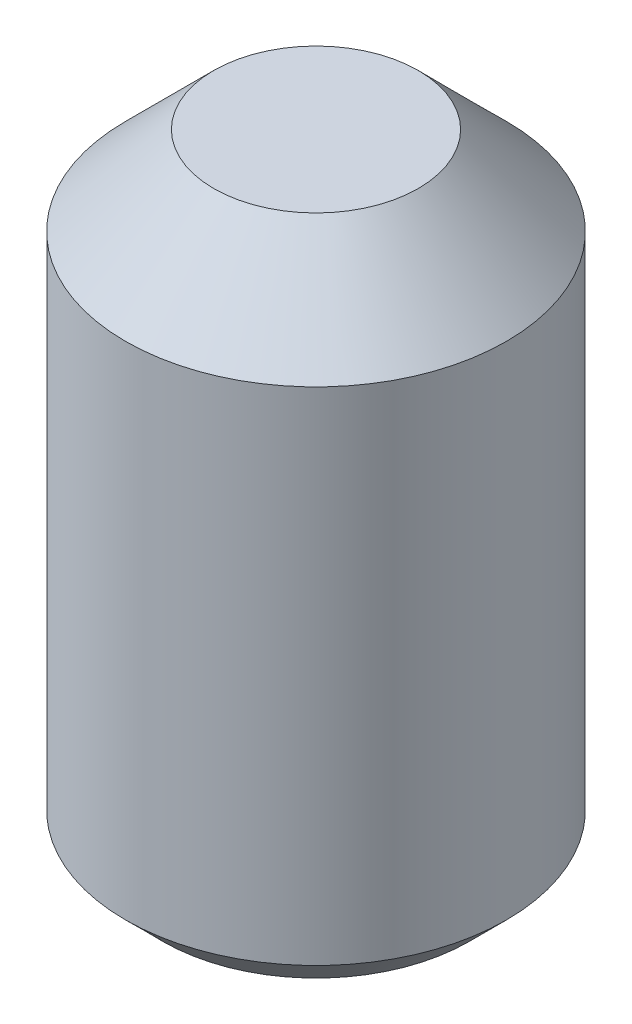
ISO-10303-21;
HEADER;
FILE_DESCRIPTION(('STEP AP214'),'2;1');
FILE_NAME('part.step','',(''),(''),'','','');
FILE_SCHEMA(('AUTOMOTIVE_DESIGN { 1 0 10303 214 1 1 1 1 }'));
ENDSEC;
DATA;
#1=APPLICATION_CONTEXT('core data for automotive mechanical design processes');
#2=APPLICATION_PROTOCOL_DEFINITION('international standard','automotive_design',2000,#1);
#3=PRODUCT_CONTEXT('',#1,'mechanical');
#4=PRODUCT('Part','Part','',(#3));
#5=PRODUCT_RELATED_PRODUCT_CATEGORY('part','',(#4));
#6=PRODUCT_DEFINITION_FORMATION('','',#4);
#7=PRODUCT_DEFINITION_CONTEXT('part definition',#1,'design');
#8=PRODUCT_DEFINITION('design','',#6,#7);
#9=PRODUCT_DEFINITION_SHAPE('','',#8);
#10=(LENGTH_UNIT() NAMED_UNIT(*) SI_UNIT(.MILLI.,.METRE.));
#11=(NAMED_UNIT(*) PLANE_ANGLE_UNIT() SI_UNIT($,.RADIAN.));
#12=(NAMED_UNIT(*) SI_UNIT($,.STERADIAN.) SOLID_ANGLE_UNIT());
#13=UNCERTAINTY_MEASURE_WITH_UNIT(LENGTH_MEASURE(1.E-05),#10,'distance_accuracy_value','');
#14=(GEOMETRIC_REPRESENTATION_CONTEXT(3) GLOBAL_UNCERTAINTY_ASSIGNED_CONTEXT((#13)) GLOBAL_UNIT_ASSIGNED_CONTEXT((#10,
#11,#12)) REPRESENTATION_CONTEXT('',''));
#15=CARTESIAN_POINT('',(0.,0.,0.));
#16=DIRECTION('',(0.,0.,1.));
#17=DIRECTION('',(1.,0.,0.));
#18=AXIS2_PLACEMENT_3D('',#15,#16,#17);
#19=CARTESIAN_POINT('',(0.,0.,0.));
#20=DIRECTION('',(0.,1.,0.));
#21=DIRECTION('',(-1.,0.,0.));
#22=AXIS2_PLACEMENT_3D('',#19,#20,#21);
#23=CYLINDRICAL_SURFACE('',#22,2.413);
#24=CARTESIAN_POINT('',(0.,0.472439999953159,0.));
#25=DIRECTION('',(0.,-1.,0.));
#26=DIRECTION('',(1.,0.,0.));
#27=AXIS2_PLACEMENT_3D('',#24,#25,#26);
#28=CIRCLE('',#27,2.413);
#29=CARTESIAN_POINT('',(2.413,0.472439999953159,0.));
#30=VERTEX_POINT('',#29);
#31=EDGE_CURVE('E41',#30,#30,#28,.F.);
#32=ORIENTED_EDGE('',*,*,#31,.T.);
#33=EDGE_LOOP('',(#32));
#34=FACE_BOUND('',#33,.T.);
#35=CARTESIAN_POINT('',(0.,6.8199,0.));
#36=DIRECTION('',(0.,1.,0.));
#37=DIRECTION('',(-1.,0.,0.));
#38=AXIS2_PLACEMENT_3D('',#35,#36,#37);
#39=CIRCLE('',#38,2.413);
#40=CARTESIAN_POINT('',(-2.413,6.8199,0.));
#41=VERTEX_POINT('',#40);
#42=EDGE_CURVE('E135',#41,#41,#39,.T.);
#43=ORIENTED_EDGE('',*,*,#42,.F.);
#44=EDGE_LOOP('',(#43));
#45=FACE_BOUND('',#44,.T.);
#46=ADVANCED_FACE('F33',(#34,#45),#23,.T.);
#47=CARTESIAN_POINT('',(2.413,0.,0.));
#48=DIRECTION('',(0.,-1.,0.));
#49=DIRECTION('',(1.,0.,0.));
#50=AXIS2_PLACEMENT_3D('',#47,#48,#49);
#51=PLANE('',#50);
#52=CARTESIAN_POINT('',(0.,0.,0.));
#53=DIRECTION('',(0.,-1.,0.));
#54=DIRECTION('',(1.,0.,0.));
#55=AXIS2_PLACEMENT_3D('',#52,#53,#54);
#56=CIRCLE('',#55,1.94056000004684);
#57=CARTESIAN_POINT('',(1.94056000004684,0.,0.));
#58=VERTEX_POINT('',#57);
#59=EDGE_CURVE('E11',#58,#58,#56,.T.);
#60=ORIENTED_EDGE('',*,*,#59,.T.);
#61=EDGE_LOOP('',(#60));
#62=FACE_BOUND('',#61,.T.);
#63=DIRECTION('',(-1.,0.,0.));
#64=VECTOR('',#63,1.);
#65=CARTESIAN_POINT('',(0.687040789999955,0.,1.18998955515204));
#66=LINE('',#65,#64);
#67=CARTESIAN_POINT('',(0.687040789999955,0.,1.18998955515204));
#68=VERTEX_POINT('',#67);
#69=CARTESIAN_POINT('',(-0.687040790000067,0.,1.18998955515204));
#70=VERTEX_POINT('',#69);
#71=EDGE_CURVE('E48',#68,#70,#66,.T.);
#72=ORIENTED_EDGE('',*,*,#71,.F.);
#73=DIRECTION('',(-0.5,0.,0.866025403784439));
#74=VECTOR('',#73,1.);
#75=CARTESIAN_POINT('',(1.37408157999982,0.,0.));
#76=LINE('',#75,#74);
#77=CARTESIAN_POINT('',(1.37408157999982,0.,0.));
#78=VERTEX_POINT('',#77);
#79=EDGE_CURVE('E131',#78,#68,#76,.T.);
#80=ORIENTED_EDGE('',*,*,#79,.F.);
#81=DIRECTION('',(0.5,0.,0.866025403784439));
#82=VECTOR('',#81,1.);
#83=CARTESIAN_POINT('',(0.687040789999932,0.,-1.18998955515205));
#84=LINE('',#83,#82);
#85=CARTESIAN_POINT('',(0.687040789999932,0.,-1.18998955515205));
#86=VERTEX_POINT('',#85);
#87=EDGE_CURVE('E129',#86,#78,#84,.T.);
#88=ORIENTED_EDGE('',*,*,#87,.F.);
#89=DIRECTION('',(1.,0.,0.));
#90=VECTOR('',#89,1.);
#91=CARTESIAN_POINT('',(-0.68704079000009,0.,-1.18998955515205));
#92=LINE('',#91,#90);
#93=CARTESIAN_POINT('',(-0.68704079000009,0.,-1.18998955515205));
#94=VERTEX_POINT('',#93);
#95=EDGE_CURVE('E96',#94,#86,#92,.T.);
#96=ORIENTED_EDGE('',*,*,#95,.F.);
#97=DIRECTION('',(0.5,0.,-0.866025403784439));
#98=VECTOR('',#97,1.);
#99=CARTESIAN_POINT('',(-1.37408157999996,0.,0.));
#100=LINE('',#99,#98);
#101=CARTESIAN_POINT('',(-1.37408157999996,0.,0.));
#102=VERTEX_POINT('',#101);
#103=EDGE_CURVE('E125',#102,#94,#100,.T.);
#104=ORIENTED_EDGE('',*,*,#103,.F.);
#105=DIRECTION('',(-0.5,0.,-0.866025403784439));
#106=VECTOR('',#105,1.);
#107=CARTESIAN_POINT('',(-0.687040790000068,0.,1.18998955515204));
#108=LINE('',#107,#106);
#109=EDGE_CURVE('E122',#70,#102,#108,.T.);
#110=ORIENTED_EDGE('',*,*,#109,.F.);
#111=EDGE_LOOP('',(#72,#80,#88,#96,#104,#110));
#112=FACE_BOUND('',#111,.T.);
#113=ADVANCED_FACE('F159',(#62,#112),#51,.T.);
#114=CARTESIAN_POINT('',(0.,7.93749999998251,0.));
#115=DIRECTION('',(0.,1.,0.));
#116=DIRECTION('',(-1.,0.,0.));
#117=AXIS2_PLACEMENT_3D('',#114,#115,#116);
#118=PLANE('',#117);
#119=CARTESIAN_POINT('',(0.,7.93749999998251,0.));
#120=DIRECTION('',(0.,1.,0.));
#121=DIRECTION('',(-1.,0.,0.));
#122=AXIS2_PLACEMENT_3D('',#119,#120,#121);
#123=CIRCLE('',#122,1.29540000001749);
#124=CARTESIAN_POINT('',(-1.29540000001749,7.93749999998251,0.));
#125=VERTEX_POINT('',#124);
#126=EDGE_CURVE('E143',#125,#125,#123,.T.);
#127=ORIENTED_EDGE('',*,*,#126,.T.);
#128=EDGE_LOOP('',(#127));
#129=FACE_BOUND('',#128,.T.);
#130=ADVANCED_FACE('F163',(#129),#118,.T.);
#131=CARTESIAN_POINT('',(0.,7.93749999998251,0.));
#132=DIRECTION('',(0.,-1.,0.));
#133=DIRECTION('',(1.,0.,0.));
#134=AXIS2_PLACEMENT_3D('',#131,#132,#133);
#135=CONICAL_SURFACE('',#134,1.29540000001749,0.785398163397448);
#136=ORIENTED_EDGE('',*,*,#42,.T.);
#137=EDGE_LOOP('',(#136));
#138=FACE_BOUND('',#137,.T.);
#139=ORIENTED_EDGE('',*,*,#126,.F.);
#140=EDGE_LOOP('',(#139));
#141=FACE_BOUND('',#140,.T.);
#142=ADVANCED_FACE('F169',(#138,#141),#135,.T.);
#143=CARTESIAN_POINT('',(0.687040789999955,2.54,1.18998955515204));
#144=DIRECTION('',(0.,0.,1.));
#145=DIRECTION('',(1.,0.,0.));
#146=AXIS2_PLACEMENT_3D('',#143,#144,#145);
#147=PLANE('',#146);
#148=ORIENTED_EDGE('',*,*,#71,.T.);
#149=DIRECTION('',(0.,-1.,0.));
#150=VECTOR('',#149,1.);
#151=CARTESIAN_POINT('',(-0.687040790000068,2.54,1.18998955515204));
#152=LINE('',#151,#150);
#153=CARTESIAN_POINT('',(-0.687040790000068,2.54,1.18998955515204));
#154=VERTEX_POINT('',#153);
#155=EDGE_CURVE('E78',#154,#70,#152,.T.);
#156=ORIENTED_EDGE('',*,*,#155,.F.);
#157=DIRECTION('',(-1.,0.,0.));
#158=VECTOR('',#157,1.);
#159=CARTESIAN_POINT('',(0.687040789999955,2.54,1.18998955515204));
#160=LINE('',#159,#158);
#161=CARTESIAN_POINT('',(0.687040789999955,2.54,1.18998955515204));
#162=VERTEX_POINT('',#161);
#163=EDGE_CURVE('E133',#162,#154,#160,.T.);
#164=ORIENTED_EDGE('',*,*,#163,.F.);
#165=DIRECTION('',(0.,-1.,0.));
#166=VECTOR('',#165,1.);
#167=CARTESIAN_POINT('',(0.687040789999955,2.54,1.18998955515204));
#168=LINE('',#167,#166);
#169=EDGE_CURVE('E56',#162,#68,#168,.T.);
#170=ORIENTED_EDGE('',*,*,#169,.T.);
#171=EDGE_LOOP('',(#148,#156,#164,#170));
#172=FACE_BOUND('',#171,.T.);
#173=ADVANCED_FACE('F173',(#172),#147,.F.);
#174=CARTESIAN_POINT('',(1.37408157999982,2.54,0.));
#175=DIRECTION('',(0.866025403784439,0.,0.5));
#176=DIRECTION('',(0.5,0.,-0.866025403784439));
#177=AXIS2_PLACEMENT_3D('',#174,#175,#176);
#178=PLANE('',#177);
#179=ORIENTED_EDGE('',*,*,#79,.T.);
#180=ORIENTED_EDGE('',*,*,#169,.F.);
#181=DIRECTION('',(-0.5,0.,0.866025403784439));
#182=VECTOR('',#181,1.);
#183=CARTESIAN_POINT('',(1.37408157999982,2.54,0.));
#184=LINE('',#183,#182);
#185=CARTESIAN_POINT('',(1.37408157999982,2.54,0.));
#186=VERTEX_POINT('',#185);
#187=EDGE_CURVE('E108',#186,#162,#184,.T.);
#188=ORIENTED_EDGE('',*,*,#187,.F.);
#189=DIRECTION('',(0.,-1.,0.));
#190=VECTOR('',#189,1.);
#191=CARTESIAN_POINT('',(1.37408157999982,2.54,0.));
#192=LINE('',#191,#190);
#193=EDGE_CURVE('E100',#186,#78,#192,.T.);
#194=ORIENTED_EDGE('',*,*,#193,.T.);
#195=EDGE_LOOP('',(#179,#180,#188,#194));
#196=FACE_BOUND('',#195,.T.);
#197=ADVANCED_FACE('F177',(#196),#178,.F.);
#198=CARTESIAN_POINT('',(0.687040789999932,2.54,-1.18998955515205));
#199=DIRECTION('',(0.866025403784439,0.,-0.5));
#200=DIRECTION('',(-0.5,0.,-0.866025403784439));
#201=AXIS2_PLACEMENT_3D('',#198,#199,#200);
#202=PLANE('',#201);
#203=ORIENTED_EDGE('',*,*,#87,.T.);
#204=ORIENTED_EDGE('',*,*,#193,.F.);
#205=DIRECTION('',(0.5,0.,0.866025403784439));
#206=VECTOR('',#205,1.);
#207=CARTESIAN_POINT('',(0.687040789999932,2.54,-1.18998955515205));
#208=LINE('',#207,#206);
#209=CARTESIAN_POINT('',(0.687040789999932,2.54,-1.18998955515205));
#210=VERTEX_POINT('',#209);
#211=EDGE_CURVE('E104',#210,#186,#208,.T.);
#212=ORIENTED_EDGE('',*,*,#211,.F.);
#213=DIRECTION('',(0.,-1.,0.));
#214=VECTOR('',#213,1.);
#215=CARTESIAN_POINT('',(0.687040789999932,2.54,-1.18998955515205));
#216=LINE('',#215,#214);
#217=EDGE_CURVE('E89',#210,#86,#216,.T.);
#218=ORIENTED_EDGE('',*,*,#217,.T.);
#219=EDGE_LOOP('',(#203,#204,#212,#218));
#220=FACE_BOUND('',#219,.T.);
#221=ADVANCED_FACE('F105',(#220),#202,.F.);
#222=CARTESIAN_POINT('',(-0.68704079000009,2.54,-1.18998955515205));
#223=DIRECTION('',(0.,0.,-1.));
#224=DIRECTION('',(-1.,0.,0.));
#225=AXIS2_PLACEMENT_3D('',#222,#223,#224);
#226=PLANE('',#225);
#227=ORIENTED_EDGE('',*,*,#95,.T.);
#228=ORIENTED_EDGE('',*,*,#217,.F.);
#229=DIRECTION('',(1.,0.,0.));
#230=VECTOR('',#229,1.);
#231=CARTESIAN_POINT('',(-0.68704079000009,2.54,-1.18998955515205));
#232=LINE('',#231,#230);
#233=CARTESIAN_POINT('',(-0.68704079000009,2.54,-1.18998955515205));
#234=VERTEX_POINT('',#233);
#235=EDGE_CURVE('E93',#234,#210,#232,.T.);
#236=ORIENTED_EDGE('',*,*,#235,.F.);
#237=DIRECTION('',(0.,-1.,0.));
#238=VECTOR('',#237,1.);
#239=CARTESIAN_POINT('',(-0.68704079000009,2.54,-1.18998955515205));
#240=LINE('',#239,#238);
#241=EDGE_CURVE('E101',#234,#94,#240,.T.);
#242=ORIENTED_EDGE('',*,*,#241,.T.);
#243=EDGE_LOOP('',(#227,#228,#236,#242));
#244=FACE_BOUND('',#243,.T.);
#245=ADVANCED_FACE('F91',(#244),#226,.F.);
#246=CARTESIAN_POINT('',(-1.37408157999996,2.54,0.));
#247=DIRECTION('',(-0.866025403784439,0.,-0.5));
#248=DIRECTION('',(-0.5,0.,0.866025403784439));
#249=AXIS2_PLACEMENT_3D('',#246,#247,#248);
#250=PLANE('',#249);
#251=ORIENTED_EDGE('',*,*,#103,.T.);
#252=ORIENTED_EDGE('',*,*,#241,.F.);
#253=DIRECTION('',(0.5,0.,-0.866025403784439));
#254=VECTOR('',#253,1.);
#255=CARTESIAN_POINT('',(-1.37408157999996,2.54,0.));
#256=LINE('',#255,#254);
#257=CARTESIAN_POINT('',(-1.37408157999996,2.54,0.));
#258=VERTEX_POINT('',#257);
#259=EDGE_CURVE('E114',#258,#234,#256,.T.);
#260=ORIENTED_EDGE('',*,*,#259,.F.);
#261=DIRECTION('',(0.,-1.,0.));
#262=VECTOR('',#261,1.);
#263=CARTESIAN_POINT('',(-1.37408157999996,2.54,0.));
#264=LINE('',#263,#262);
#265=EDGE_CURVE('E138',#258,#102,#264,.T.);
#266=ORIENTED_EDGE('',*,*,#265,.T.);
#267=EDGE_LOOP('',(#251,#252,#260,#266));
#268=FACE_BOUND('',#267,.T.);
#269=ADVANCED_FACE('F180',(#268),#250,.F.);
#270=CARTESIAN_POINT('',(-0.687040790000068,2.54,1.18998955515204));
#271=DIRECTION('',(-0.866025403784439,0.,0.5));
#272=DIRECTION('',(0.5,0.,0.866025403784439));
#273=AXIS2_PLACEMENT_3D('',#270,#271,#272);
#274=PLANE('',#273);
#275=ORIENTED_EDGE('',*,*,#109,.T.);
#276=ORIENTED_EDGE('',*,*,#265,.F.);
#277=DIRECTION('',(-0.5,0.,-0.866025403784439));
#278=VECTOR('',#277,1.);
#279=CARTESIAN_POINT('',(-0.687040790000068,2.54,1.18998955515204));
#280=LINE('',#279,#278);
#281=EDGE_CURVE('E116',#154,#258,#280,.T.);
#282=ORIENTED_EDGE('',*,*,#281,.F.);
#283=ORIENTED_EDGE('',*,*,#155,.T.);
#284=EDGE_LOOP('',(#275,#276,#282,#283));
#285=FACE_BOUND('',#284,.T.);
#286=ADVANCED_FACE('F155',(#285),#274,.F.);
#287=CARTESIAN_POINT('',(0.,2.54,0.));
#288=DIRECTION('',(0.,-1.,0.));
#289=DIRECTION('',(0.,0.,-1.));
#290=AXIS2_PLACEMENT_3D('',#287,#288,#289);
#291=PLANE('',#290);
#292=ORIENTED_EDGE('',*,*,#163,.T.);
#293=ORIENTED_EDGE('',*,*,#281,.T.);
#294=ORIENTED_EDGE('',*,*,#259,.T.);
#295=ORIENTED_EDGE('',*,*,#235,.T.);
#296=ORIENTED_EDGE('',*,*,#211,.T.);
#297=ORIENTED_EDGE('',*,*,#187,.T.);
#298=EDGE_LOOP('',(#292,#293,#294,#295,#296,#297));
#299=FACE_BOUND('',#298,.T.);
#300=ADVANCED_FACE('F111',(#299),#291,.T.);
#301=CARTESIAN_POINT('',(0.,0.472439999953159,0.));
#302=DIRECTION('',(0.,1.,0.));
#303=DIRECTION('',(-1.,0.,0.));
#304=AXIS2_PLACEMENT_3D('',#301,#302,#303);
#305=CONICAL_SURFACE('',#304,2.413,0.785398163397451);
#306=ORIENTED_EDGE('',*,*,#59,.F.);
#307=EDGE_LOOP('',(#306));
#308=FACE_BOUND('',#307,.T.);
#309=ORIENTED_EDGE('',*,*,#31,.F.);
#310=EDGE_LOOP('',(#309));
#311=FACE_BOUND('',#310,.T.);
#312=ADVANCED_FACE('F35',(#308,#311),#305,.T.);
#313=CLOSED_SHELL('',(#46,#113,#130,#142,#173,#197,#221,#245,#269,#286,#300,#312));
#314=MANIFOLD_SOLID_BREP('B2',#313);
#315=ADVANCED_BREP_SHAPE_REPRESENTATION('',(#18,#314),#14);
#316=SHAPE_DEFINITION_REPRESENTATION(#9,#315);
ENDSEC;
END-ISO-10303-21;
